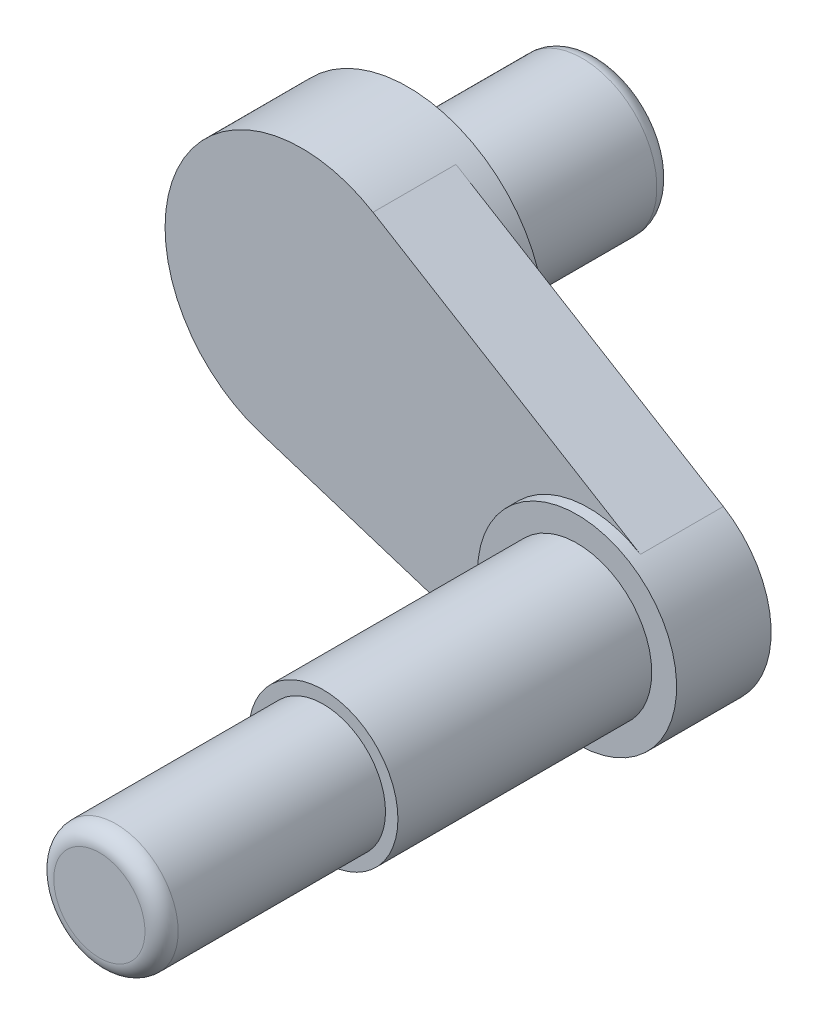
ISO-10303-21;
HEADER;
FILE_DESCRIPTION(('STEP AP214'),'2;1');
FILE_NAME('part.step','',(''),(''),'','','');
FILE_SCHEMA(('AUTOMOTIVE_DESIGN { 1 0 10303 214 1 1 1 1 }'));
ENDSEC;
DATA;
#1=APPLICATION_CONTEXT('core data for automotive mechanical design processes');
#2=APPLICATION_PROTOCOL_DEFINITION('international standard','automotive_design',2000,#1);
#3=PRODUCT_CONTEXT('',#1,'mechanical');
#4=PRODUCT('Part','Part','',(#3));
#5=PRODUCT_RELATED_PRODUCT_CATEGORY('part','',(#4));
#6=PRODUCT_DEFINITION_FORMATION('','',#4);
#7=PRODUCT_DEFINITION_CONTEXT('part definition',#1,'design');
#8=PRODUCT_DEFINITION('design','',#6,#7);
#9=PRODUCT_DEFINITION_SHAPE('','',#8);
#10=(LENGTH_UNIT() NAMED_UNIT(*) SI_UNIT(.MILLI.,.METRE.));
#11=(NAMED_UNIT(*) PLANE_ANGLE_UNIT() SI_UNIT($,.RADIAN.));
#12=(NAMED_UNIT(*) SI_UNIT($,.STERADIAN.) SOLID_ANGLE_UNIT());
#13=UNCERTAINTY_MEASURE_WITH_UNIT(LENGTH_MEASURE(1.E-05),#10,'distance_accuracy_value','');
#14=(GEOMETRIC_REPRESENTATION_CONTEXT(3) GLOBAL_UNCERTAINTY_ASSIGNED_CONTEXT((#13)) GLOBAL_UNIT_ASSIGNED_CONTEXT((#10,
#11,#12)) REPRESENTATION_CONTEXT('',''));
#15=CARTESIAN_POINT('',(0.,0.,0.));
#16=DIRECTION('',(0.,0.,1.));
#17=DIRECTION('',(1.,0.,0.));
#18=AXIS2_PLACEMENT_3D('',#15,#16,#17);
#19=CARTESIAN_POINT('',(0.,0.,-100.));
#20=DIRECTION('',(0.,0.,1.));
#21=DIRECTION('',(1.,0.,0.));
#22=AXIS2_PLACEMENT_3D('',#19,#20,#21);
#23=PLANE('',#22);
#24=CARTESIAN_POINT('',(0.,0.,-100.));
#25=DIRECTION('',(0.,0.,-1.));
#26=DIRECTION('',(-1.,0.,0.));
#27=AXIS2_PLACEMENT_3D('',#24,#25,#26);
#28=CIRCLE('',#27,34.9999999999999);
#29=CARTESIAN_POINT('',(-34.9999999999999,0.,-100.));
#30=VERTEX_POINT('',#29);
#31=EDGE_CURVE('E138',#30,#30,#28,.T.);
#32=ORIENTED_EDGE('',*,*,#31,.T.);
#33=EDGE_LOOP('',(#32));
#34=FACE_BOUND('',#33,.T.);
#35=ADVANCED_FACE('F41',(#34),#23,.F.);
#36=CARTESIAN_POINT('',(0.,0.,-90.));
#37=DIRECTION('',(0.,0.,-1.));
#38=DIRECTION('',(-1.,0.,0.));
#39=AXIS2_PLACEMENT_3D('',#36,#37,#38);
#40=TOROIDAL_SURFACE('',#39,35.,9.99999999999999);
#41=CARTESIAN_POINT('',(0.,0.,-89.9999999999999));
#42=DIRECTION('',(0.,0.,-1.));
#43=DIRECTION('',(-1.,0.,0.));
#44=AXIS2_PLACEMENT_3D('',#41,#42,#43);
#45=CIRCLE('',#44,45.);
#46=CARTESIAN_POINT('',(-45.,0.,-89.9999999999999));
#47=VERTEX_POINT('',#46);
#48=EDGE_CURVE('E135',#47,#47,#45,.T.);
#49=ORIENTED_EDGE('',*,*,#48,.T.);
#50=EDGE_LOOP('',(#49));
#51=FACE_BOUND('',#50,.T.);
#52=ORIENTED_EDGE('',*,*,#31,.F.);
#53=EDGE_LOOP('',(#52));
#54=FACE_BOUND('',#53,.T.);
#55=ADVANCED_FACE('F182',(#51,#54),#40,.T.);
#56=CARTESIAN_POINT('',(0.,0.,-100.));
#57=DIRECTION('',(0.,0.,-1.));
#58=DIRECTION('',(-1.,0.,0.));
#59=AXIS2_PLACEMENT_3D('',#56,#57,#58);
#60=CYLINDRICAL_SURFACE('',#59,45.);
#61=ORIENTED_EDGE('',*,*,#48,.F.);
#62=EDGE_LOOP('',(#61));
#63=FACE_BOUND('',#62,.T.);
#64=CARTESIAN_POINT('',(0.,0.,0.));
#65=DIRECTION('',(0.,0.,-1.));
#66=DIRECTION('',(-1.,0.,0.));
#67=AXIS2_PLACEMENT_3D('',#64,#65,#66);
#68=CIRCLE('',#67,45.);
#69=CARTESIAN_POINT('',(-45.,0.,0.));
#70=VERTEX_POINT('',#69);
#71=EDGE_CURVE('E132',#70,#70,#68,.T.);
#72=ORIENTED_EDGE('',*,*,#71,.T.);
#73=EDGE_LOOP('',(#72));
#74=FACE_BOUND('',#73,.T.);
#75=ADVANCED_FACE('F187',(#63,#74),#60,.T.);
#76=CARTESIAN_POINT('',(0.,0.,0.));
#77=DIRECTION('',(0.,0.,-1.));
#78=DIRECTION('',(-1.,0.,0.));
#79=AXIS2_PLACEMENT_3D('',#76,#77,#78);
#80=PLANE('',#79);
#81=CARTESIAN_POINT('',(0.,0.,0.));
#82=DIRECTION('',(0.,0.,-1.));
#83=DIRECTION('',(-1.,0.,0.));
#84=AXIS2_PLACEMENT_3D('',#81,#82,#83);
#85=CIRCLE('',#84,50.);
#86=CARTESIAN_POINT('',(-50.,0.,0.));
#87=VERTEX_POINT('',#86);
#88=EDGE_CURVE('E129',#87,#87,#85,.T.);
#89=ORIENTED_EDGE('',*,*,#88,.T.);
#90=EDGE_LOOP('',(#89));
#91=FACE_BOUND('',#90,.T.);
#92=ORIENTED_EDGE('',*,*,#71,.F.);
#93=EDGE_LOOP('',(#92));
#94=FACE_BOUND('',#93,.T.);
#95=ADVANCED_FACE('F193',(#91,#94),#80,.T.);
#96=CARTESIAN_POINT('',(0.,0.,-100.));
#97=DIRECTION('',(0.,0.,-1.));
#98=DIRECTION('',(-1.,0.,0.));
#99=AXIS2_PLACEMENT_3D('',#96,#97,#98);
#100=CYLINDRICAL_SURFACE('',#99,50.);
#101=CARTESIAN_POINT('',(0.,0.,15.));
#102=DIRECTION('',(0.,0.,-1.));
#103=DIRECTION('',(-1.,0.,0.));
#104=AXIS2_PLACEMENT_3D('',#101,#102,#103);
#105=CIRCLE('',#104,50.);
#106=CARTESIAN_POINT('',(-50.,0.,15.));
#107=VERTEX_POINT('',#106);
#108=EDGE_CURVE('E126',#107,#107,#105,.T.);
#109=ORIENTED_EDGE('',*,*,#108,.T.);
#110=EDGE_LOOP('',(#109));
#111=FACE_BOUND('',#110,.T.);
#112=ORIENTED_EDGE('',*,*,#88,.F.);
#113=EDGE_LOOP('',(#112));
#114=FACE_BOUND('',#113,.T.);
#115=ADVANCED_FACE('F197',(#111,#114),#100,.T.);
#116=CARTESIAN_POINT('',(0.,0.,15.));
#117=DIRECTION('',(0.,0.,1.));
#118=DIRECTION('',(1.,0.,0.));
#119=AXIS2_PLACEMENT_3D('',#116,#117,#118);
#120=PLANE('',#119);
#121=ORIENTED_EDGE('',*,*,#108,.F.);
#122=EDGE_LOOP('',(#121));
#123=FACE_BOUND('',#122,.T.);
#124=CARTESIAN_POINT('',(0.,0.,15.));
#125=DIRECTION('',(0.,0.,-1.));
#126=DIRECTION('',(-1.,0.,0.));
#127=AXIS2_PLACEMENT_3D('',#124,#125,#126);
#128=CIRCLE('',#127,82.5);
#129=CARTESIAN_POINT('',(-82.5,0.,15.));
#130=VERTEX_POINT('',#129);
#131=EDGE_CURVE('E123',#130,#130,#128,.T.);
#132=ORIENTED_EDGE('',*,*,#131,.T.);
#133=EDGE_LOOP('',(#132));
#134=FACE_BOUND('',#133,.T.);
#135=ADVANCED_FACE('F201',(#123,#134),#120,.F.);
#136=CARTESIAN_POINT('',(0.,0.,-100.));
#137=DIRECTION('',(0.,0.,-1.));
#138=DIRECTION('',(-1.,0.,0.));
#139=AXIS2_PLACEMENT_3D('',#136,#137,#138);
#140=CYLINDRICAL_SURFACE('',#139,82.5);
#141=DIRECTION('',(0.,0.,1.));
#142=VECTOR('',#141,1.);
#143=CARTESIAN_POINT('',(-25.0813752736574,-78.5950037494875,29.));
#144=LINE('',#143,#142);
#145=CARTESIAN_POINT('',(-25.0813752736574,-78.5950037494875,29.));
#146=VERTEX_POINT('',#145);
#147=CARTESIAN_POINT('',(-25.0813752736574,-78.5950037494875,79.));
#148=VERTEX_POINT('',#147);
#149=EDGE_CURVE('E119',#146,#148,#144,.T.);
#150=ORIENTED_EDGE('',*,*,#149,.T.);
#151=CARTESIAN_POINT('',(0.,0.,79.));
#152=DIRECTION('',(0.,0.,-1.));
#153=DIRECTION('',(-1.,0.,0.));
#154=AXIS2_PLACEMENT_3D('',#151,#152,#153);
#155=CIRCLE('',#154,82.5);
#156=CARTESIAN_POINT('',(42.8615395796003,70.4921160475861,79.));
#157=VERTEX_POINT('',#156);
#158=EDGE_CURVE('E118',#148,#157,#155,.T.);
#159=ORIENTED_EDGE('',*,*,#158,.T.);
#160=DIRECTION('',(0.,0.,1.));
#161=VECTOR('',#160,1.);
#162=CARTESIAN_POINT('',(42.8615395796003,70.4921160475861,29.));
#163=LINE('',#162,#161);
#164=CARTESIAN_POINT('',(42.8615395796003,70.4921160475861,29.));
#165=VERTEX_POINT('',#164);
#166=EDGE_CURVE('E61',#165,#157,#163,.T.);
#167=ORIENTED_EDGE('',*,*,#166,.F.);
#168=CARTESIAN_POINT('',(0.,0.,29.));
#169=DIRECTION('',(0.,0.,1.));
#170=DIRECTION('',(1.,0.,0.));
#171=AXIS2_PLACEMENT_3D('',#168,#169,#170);
#172=CIRCLE('',#171,82.5);
#173=EDGE_CURVE('E56',#165,#146,#172,.F.);
#174=ORIENTED_EDGE('',*,*,#173,.T.);
#175=EDGE_LOOP('',(#150,#159,#167,#174));
#176=FACE_BOUND('',#175,.T.);
#177=ORIENTED_EDGE('',*,*,#131,.F.);
#178=EDGE_LOOP('',(#177));
#179=FACE_BOUND('',#178,.T.);
#180=ADVANCED_FACE('F178',(#176,#179),#140,.T.);
#181=CARTESIAN_POINT('',(0.,0.,79.));
#182=DIRECTION('',(0.,0.,1.));
#183=DIRECTION('',(1.,0.,0.));
#184=AXIS2_PLACEMENT_3D('',#181,#182,#183);
#185=PLANE('',#184);
#186=CARTESIAN_POINT('',(172.892641466543,-78.7917161046849,79.));
#187=DIRECTION('',(0.,0.,1.));
#188=DIRECTION('',(1.,0.,0.));
#189=AXIS2_PLACEMENT_3D('',#186,#187,#188);
#190=CIRCLE('',#189,60.);
#191=CARTESIAN_POINT('',(204.064670251707,-27.5247226155313,79.));
#192=VERTEX_POINT('',#191);
#193=CARTESIAN_POINT('',(154.65164126752,-135.951718831585,79.));
#194=VERTEX_POINT('',#193);
#195=EDGE_CURVE('E89',#192,#194,#190,.T.);
#196=ORIENTED_EDGE('',*,*,#195,.F.);
#197=DIRECTION('',(-0.854449891485893,0.519533813086065,0.));
#198=VECTOR('',#197,1.);
#199=CARTESIAN_POINT('',(204.064670251707,-27.5247226155313,79.));
#200=LINE('',#199,#198);
#201=EDGE_CURVE('E80',#192,#157,#200,.T.);
#202=ORIENTED_EDGE('',*,*,#201,.T.);
#203=ORIENTED_EDGE('',*,*,#158,.F.);
#204=DIRECTION('',(0.952666712115001,-0.304016669983726,0.));
#205=VECTOR('',#204,1.);
#206=CARTESIAN_POINT('',(154.65164126752,-135.951718831585,79.));
#207=LINE('',#206,#205);
#208=EDGE_CURVE('E88',#148,#194,#207,.T.);
#209=ORIENTED_EDGE('',*,*,#208,.T.);
#210=EDGE_LOOP('',(#196,#202,#203,#209));
#211=FACE_BOUND('',#210,.T.);
#212=ADVANCED_FACE('F101',(#211),#185,.T.);
#213=CARTESIAN_POINT('',(172.892641466543,-78.7917161046849,29.));
#214=DIRECTION('',(0.,0.,1.));
#215=DIRECTION('',(1.,0.,0.));
#216=AXIS2_PLACEMENT_3D('',#213,#214,#215);
#217=CYLINDRICAL_SURFACE('',#216,60.);
#218=DIRECTION('',(0.,0.,1.));
#219=VECTOR('',#218,1.);
#220=CARTESIAN_POINT('',(204.064670251707,-27.5247226155313,29.));
#221=LINE('',#220,#219);
#222=CARTESIAN_POINT('',(204.064670251707,-27.5247226155313,29.));
#223=VERTEX_POINT('',#222);
#224=EDGE_CURVE('E84',#223,#192,#221,.T.);
#225=ORIENTED_EDGE('',*,*,#224,.T.);
#226=ORIENTED_EDGE('',*,*,#195,.T.);
#227=DIRECTION('',(0.,0.,1.));
#228=VECTOR('',#227,1.);
#229=CARTESIAN_POINT('',(154.65164126752,-135.951718831585,29.));
#230=LINE('',#229,#228);
#231=CARTESIAN_POINT('',(154.65164126752,-135.951718831585,29.));
#232=VERTEX_POINT('',#231);
#233=EDGE_CURVE('E116',#232,#194,#230,.T.);
#234=ORIENTED_EDGE('',*,*,#233,.F.);
#235=CARTESIAN_POINT('',(172.892641466543,-78.7917161046849,29.));
#236=DIRECTION('',(0.,0.,1.));
#237=DIRECTION('',(1.,0.,0.));
#238=AXIS2_PLACEMENT_3D('',#235,#236,#237);
#239=CIRCLE('',#238,60.);
#240=EDGE_CURVE('E97',#232,#223,#239,.T.);
#241=ORIENTED_EDGE('',*,*,#240,.T.);
#242=EDGE_LOOP('',(#225,#226,#234,#241));
#243=FACE_BOUND('',#242,.T.);
#244=CARTESIAN_POINT('',(172.892641466543,-78.7917161046849,86.));
#245=DIRECTION('',(0.,0.,-1.));
#246=DIRECTION('',(-1.,0.,0.));
#247=AXIS2_PLACEMENT_3D('',#244,#245,#246);
#248=CIRCLE('',#247,60.);
#249=CARTESIAN_POINT('',(112.892641466543,-78.7917161046849,86.));
#250=VERTEX_POINT('',#249);
#251=EDGE_CURVE('E103',#250,#250,#248,.T.);
#252=ORIENTED_EDGE('',*,*,#251,.T.);
#253=EDGE_LOOP('',(#252));
#254=FACE_BOUND('',#253,.T.);
#255=ADVANCED_FACE('F94',(#243,#254),#217,.T.);
#256=CARTESIAN_POINT('',(154.65164126752,-135.951718831585,29.));
#257=DIRECTION('',(-0.304016669983726,-0.952666712115001,0.));
#258=DIRECTION('',(0.952666712115001,-0.304016669983726,0.));
#259=AXIS2_PLACEMENT_3D('',#256,#257,#258);
#260=PLANE('',#259);
#261=ORIENTED_EDGE('',*,*,#208,.F.);
#262=ORIENTED_EDGE('',*,*,#149,.F.);
#263=DIRECTION('',(0.952666712115001,-0.304016669983726,0.));
#264=VECTOR('',#263,1.);
#265=CARTESIAN_POINT('',(154.65164126752,-135.951718831585,29.));
#266=LINE('',#265,#264);
#267=EDGE_CURVE('E98',#146,#232,#266,.T.);
#268=ORIENTED_EDGE('',*,*,#267,.T.);
#269=ORIENTED_EDGE('',*,*,#233,.T.);
#270=EDGE_LOOP('',(#261,#262,#268,#269));
#271=FACE_BOUND('',#270,.T.);
#272=ADVANCED_FACE('F170',(#271),#260,.T.);
#273=CARTESIAN_POINT('',(204.064670251707,-27.5247226155313,29.));
#274=DIRECTION('',(0.519533813086065,0.854449891485893,0.));
#275=DIRECTION('',(-0.854449891485893,0.519533813086065,0.));
#276=AXIS2_PLACEMENT_3D('',#273,#274,#275);
#277=PLANE('',#276);
#278=ORIENTED_EDGE('',*,*,#201,.F.);
#279=ORIENTED_EDGE('',*,*,#224,.F.);
#280=DIRECTION('',(-0.854449891485893,0.519533813086065,0.));
#281=VECTOR('',#280,1.);
#282=CARTESIAN_POINT('',(204.064670251707,-27.5247226155313,29.));
#283=LINE('',#282,#281);
#284=EDGE_CURVE('E111',#223,#165,#283,.T.);
#285=ORIENTED_EDGE('',*,*,#284,.T.);
#286=ORIENTED_EDGE('',*,*,#166,.T.);
#287=EDGE_LOOP('',(#278,#279,#285,#286));
#288=FACE_BOUND('',#287,.T.);
#289=ADVANCED_FACE('F82',(#288),#277,.T.);
#290=CARTESIAN_POINT('',(172.892641466543,-78.7917161046849,29.));
#291=DIRECTION('',(0.,0.,1.));
#292=DIRECTION('',(1.,0.,0.));
#293=AXIS2_PLACEMENT_3D('',#290,#291,#292);
#294=PLANE('',#293);
#295=ORIENTED_EDGE('',*,*,#284,.F.);
#296=ORIENTED_EDGE('',*,*,#240,.F.);
#297=ORIENTED_EDGE('',*,*,#267,.F.);
#298=ORIENTED_EDGE('',*,*,#173,.F.);
#299=EDGE_LOOP('',(#295,#296,#297,#298));
#300=FACE_BOUND('',#299,.T.);
#301=ADVANCED_FACE('F166',(#300),#294,.F.);
#302=CARTESIAN_POINT('',(172.892641466543,-78.7917161046849,86.));
#303=DIRECTION('',(0.,0.,-1.));
#304=DIRECTION('',(-1.,0.,0.));
#305=AXIS2_PLACEMENT_3D('',#302,#303,#304);
#306=PLANE('',#305);
#307=CARTESIAN_POINT('',(172.892641466543,-78.7917161046849,86.));
#308=DIRECTION('',(0.,0.,1.));
#309=DIRECTION('',(1.,0.,0.));
#310=AXIS2_PLACEMENT_3D('',#307,#308,#309);
#311=CIRCLE('',#310,45.);
#312=CARTESIAN_POINT('',(217.892641466543,-78.7917161046849,86.));
#313=VERTEX_POINT('',#312);
#314=EDGE_CURVE('E141',#313,#313,#311,.T.);
#315=ORIENTED_EDGE('',*,*,#314,.F.);
#316=EDGE_LOOP('',(#315));
#317=FACE_BOUND('',#316,.T.);
#318=ORIENTED_EDGE('',*,*,#251,.F.);
#319=EDGE_LOOP('',(#318));
#320=FACE_BOUND('',#319,.T.);
#321=ADVANCED_FACE('F160',(#317,#320),#306,.F.);
#322=CARTESIAN_POINT('',(172.892641466543,-78.7917161046849,239.));
#323=DIRECTION('',(0.,0.,-1.));
#324=DIRECTION('',(-1.,0.,0.));
#325=AXIS2_PLACEMENT_3D('',#322,#323,#324);
#326=CYLINDRICAL_SURFACE('',#325,45.);
#327=CARTESIAN_POINT('',(172.892641466543,-78.7917161046849,239.));
#328=DIRECTION('',(0.,0.,1.));
#329=DIRECTION('',(1.,0.,0.));
#330=AXIS2_PLACEMENT_3D('',#327,#328,#329);
#331=CIRCLE('',#330,45.);
#332=CARTESIAN_POINT('',(217.892641466543,-78.7917161046849,239.));
#333=VERTEX_POINT('',#332);
#334=EDGE_CURVE('E106',#333,#333,#331,.T.);
#335=ORIENTED_EDGE('',*,*,#334,.F.);
#336=EDGE_LOOP('',(#335));
#337=FACE_BOUND('',#336,.T.);
#338=ORIENTED_EDGE('',*,*,#314,.T.);
#339=EDGE_LOOP('',(#338));
#340=FACE_BOUND('',#339,.T.);
#341=ADVANCED_FACE('F157',(#337,#340),#326,.T.);
#342=CARTESIAN_POINT('',(172.892641466543,-78.7917161046849,239.));
#343=DIRECTION('',(0.,0.,1.));
#344=DIRECTION('',(1.,0.,0.));
#345=AXIS2_PLACEMENT_3D('',#342,#343,#344);
#346=PLANE('',#345);
#347=CARTESIAN_POINT('',(172.892641466543,-78.7917161046849,239.));
#348=DIRECTION('',(0.,0.,1.));
#349=DIRECTION('',(1.,0.,0.));
#350=AXIS2_PLACEMENT_3D('',#347,#348,#349);
#351=CIRCLE('',#350,37.5);
#352=CARTESIAN_POINT('',(210.392641466543,-78.7917161046849,239.));
#353=VERTEX_POINT('',#352);
#354=EDGE_CURVE('E143',#353,#353,#351,.T.);
#355=ORIENTED_EDGE('',*,*,#354,.F.);
#356=EDGE_LOOP('',(#355));
#357=FACE_BOUND('',#356,.T.);
#358=ORIENTED_EDGE('',*,*,#334,.T.);
#359=EDGE_LOOP('',(#358));
#360=FACE_BOUND('',#359,.T.);
#361=ADVANCED_FACE('F155',(#357,#360),#346,.T.);
#362=CARTESIAN_POINT('',(172.892641466543,-78.7917161046849,374.));
#363=DIRECTION('',(0.,0.,-1.));
#364=DIRECTION('',(-1.,0.,0.));
#365=AXIS2_PLACEMENT_3D('',#362,#363,#364);
#366=CYLINDRICAL_SURFACE('',#365,37.5);
#367=CARTESIAN_POINT('',(172.892641466543,-78.7917161046849,364.));
#368=DIRECTION('',(0.,0.,1.));
#369=DIRECTION('',(1.,0.,0.));
#370=AXIS2_PLACEMENT_3D('',#367,#368,#369);
#371=CIRCLE('',#370,37.5);
#372=CARTESIAN_POINT('',(210.392641466543,-78.7917161046849,364.));
#373=VERTEX_POINT('',#372);
#374=EDGE_CURVE('E11',#373,#373,#371,.F.);
#375=ORIENTED_EDGE('',*,*,#374,.T.);
#376=EDGE_LOOP('',(#375));
#377=FACE_BOUND('',#376,.T.);
#378=ORIENTED_EDGE('',*,*,#354,.T.);
#379=EDGE_LOOP('',(#378));
#380=FACE_BOUND('',#379,.T.);
#381=ADVANCED_FACE('F222',(#377,#380),#366,.T.);
#382=CARTESIAN_POINT('',(172.892641466543,-78.7917161046849,374.));
#383=DIRECTION('',(0.,0.,1.));
#384=DIRECTION('',(1.,0.,0.));
#385=AXIS2_PLACEMENT_3D('',#382,#383,#384);
#386=PLANE('',#385);
#387=CARTESIAN_POINT('',(172.892641466543,-78.7917161046849,374.));
#388=DIRECTION('',(0.,0.,1.));
#389=DIRECTION('',(1.,0.,0.));
#390=AXIS2_PLACEMENT_3D('',#387,#388,#389);
#391=CIRCLE('',#390,27.5);
#392=CARTESIAN_POINT('',(200.392641466543,-78.7917161046849,374.));
#393=VERTEX_POINT('',#392);
#394=EDGE_CURVE('E49',#393,#393,#391,.T.);
#395=ORIENTED_EDGE('',*,*,#394,.T.);
#396=EDGE_LOOP('',(#395));
#397=FACE_BOUND('',#396,.T.);
#398=ADVANCED_FACE('F226',(#397),#386,.T.);
#399=CARTESIAN_POINT('',(172.892641466543,-78.7917161046849,364.));
#400=DIRECTION('',(0.,0.,1.));
#401=DIRECTION('',(1.,0.,0.));
#402=AXIS2_PLACEMENT_3D('',#399,#400,#401);
#403=TOROIDAL_SURFACE('',#402,27.5,10.);
#404=ORIENTED_EDGE('',*,*,#374,.F.);
#405=EDGE_LOOP('',(#404));
#406=FACE_BOUND('',#405,.T.);
#407=ORIENTED_EDGE('',*,*,#394,.F.);
#408=EDGE_LOOP('',(#407));
#409=FACE_BOUND('',#408,.T.);
#410=ADVANCED_FACE('F43',(#406,#409),#403,.T.);
#411=CLOSED_SHELL('',(#35,#55,#75,#95,#115,#135,#180,#212,#255,#272,#289,#301,#321,#341,#361,
#381,#398,#410));
#412=MANIFOLD_SOLID_BREP('B2',#411);
#413=ADVANCED_BREP_SHAPE_REPRESENTATION('',(#18,#412),#14);
#414=SHAPE_DEFINITION_REPRESENTATION(#9,#413);
ENDSEC;
END-ISO-10303-21;
